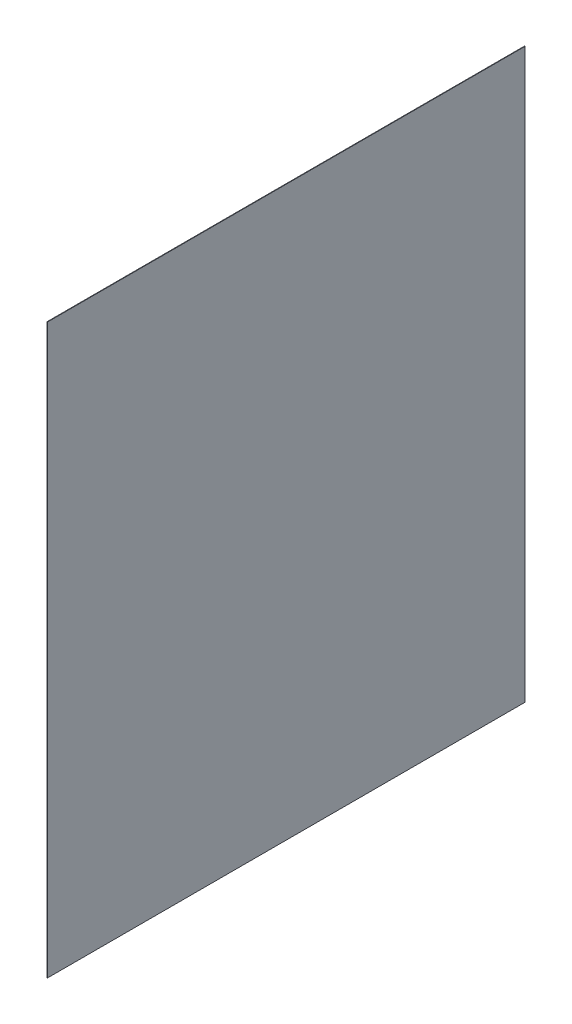
ISO-10303-21;
HEADER;
FILE_DESCRIPTION(('STEP AP214'),'2;1');
FILE_NAME('part.step','',(''),(''),'','','');
FILE_SCHEMA(('AUTOMOTIVE_DESIGN { 1 0 10303 214 1 1 1 1 }'));
ENDSEC;
DATA;
#1=APPLICATION_CONTEXT('core data for automotive mechanical design processes');
#2=APPLICATION_PROTOCOL_DEFINITION('international standard','automotive_design',2000,#1);
#3=PRODUCT_CONTEXT('',#1,'mechanical');
#4=PRODUCT('Part','Part','',(#3));
#5=PRODUCT_RELATED_PRODUCT_CATEGORY('part','',(#4));
#6=PRODUCT_DEFINITION_FORMATION('','',#4);
#7=PRODUCT_DEFINITION_CONTEXT('part definition',#1,'design');
#8=PRODUCT_DEFINITION('design','',#6,#7);
#9=PRODUCT_DEFINITION_SHAPE('','',#8);
#10=(LENGTH_UNIT() NAMED_UNIT(*) SI_UNIT(.MILLI.,.METRE.));
#11=(NAMED_UNIT(*) PLANE_ANGLE_UNIT() SI_UNIT($,.RADIAN.));
#12=(NAMED_UNIT(*) SI_UNIT($,.STERADIAN.) SOLID_ANGLE_UNIT());
#13=UNCERTAINTY_MEASURE_WITH_UNIT(LENGTH_MEASURE(1.E-05),#10,'distance_accuracy_value','');
#14=(GEOMETRIC_REPRESENTATION_CONTEXT(3) GLOBAL_UNCERTAINTY_ASSIGNED_CONTEXT((#13)) GLOBAL_UNIT_ASSIGNED_CONTEXT((#10,
#11,#12)) REPRESENTATION_CONTEXT('',''));
#15=CARTESIAN_POINT('',(0.,0.,0.));
#16=DIRECTION('',(0.,0.,1.));
#17=DIRECTION('',(1.,0.,0.));
#18=AXIS2_PLACEMENT_3D('',#15,#16,#17);
#19=CARTESIAN_POINT('',(-0.7,0.,0.));
#20=DIRECTION('',(0.,0.,1.));
#21=DIRECTION('',(1.,0.,0.));
#22=AXIS2_PLACEMENT_3D('',#19,#20,#21);
#23=PLANE('',#22);
#24=DIRECTION('',(0.,-1.,0.));
#25=VECTOR('',#24,1.);
#26=CARTESIAN_POINT('',(0.,0.,0.));
#27=LINE('',#26,#25);
#28=CARTESIAN_POINT('',(0.,787.05,0.));
#29=VERTEX_POINT('',#28);
#30=CARTESIAN_POINT('',(0.,0.,0.));
#31=VERTEX_POINT('',#30);
#32=EDGE_CURVE('E103',#29,#31,#27,.T.);
#33=ORIENTED_EDGE('',*,*,#32,.F.);
#34=DIRECTION('',(1.,0.,0.));
#35=VECTOR('',#34,1.);
#36=CARTESIAN_POINT('',(-0.7,787.05,0.));
#37=LINE('',#36,#35);
#38=CARTESIAN_POINT('',(-0.7,787.05,0.));
#39=VERTEX_POINT('',#38);
#40=EDGE_CURVE('E11',#39,#29,#37,.T.);
#41=ORIENTED_EDGE('',*,*,#40,.F.);
#42=DIRECTION('',(0.,-1.,0.));
#43=VECTOR('',#42,1.);
#44=CARTESIAN_POINT('',(-0.7,0.,0.));
#45=LINE('',#44,#43);
#46=CARTESIAN_POINT('',(-0.7,0.,0.));
#47=VERTEX_POINT('',#46);
#48=EDGE_CURVE('E97',#39,#47,#45,.T.);
#49=ORIENTED_EDGE('',*,*,#48,.T.);
#50=DIRECTION('',(1.,0.,0.));
#51=VECTOR('',#50,1.);
#52=CARTESIAN_POINT('',(-0.7,0.,0.));
#53=LINE('',#52,#51);
#54=EDGE_CURVE('E42',#47,#31,#53,.T.);
#55=ORIENTED_EDGE('',*,*,#54,.T.);
#56=EDGE_LOOP('',(#33,#41,#49,#55));
#57=FACE_BOUND('',#56,.T.);
#58=ADVANCED_FACE('F39',(#57),#23,.T.);
#59=CARTESIAN_POINT('',(-0.7,787.05,0.));
#60=DIRECTION('',(0.,1.,0.));
#61=DIRECTION('',(0.,0.,1.));
#62=AXIS2_PLACEMENT_3D('',#59,#60,#61);
#63=PLANE('',#62);
#64=DIRECTION('',(0.,0.,1.));
#65=VECTOR('',#64,1.);
#66=CARTESIAN_POINT('',(0.,787.05,0.));
#67=LINE('',#66,#65);
#68=CARTESIAN_POINT('',(0.,787.05,-661.7));
#69=VERTEX_POINT('',#68);
#70=EDGE_CURVE('E99',#69,#29,#67,.T.);
#71=ORIENTED_EDGE('',*,*,#70,.F.);
#72=DIRECTION('',(1.,0.,0.));
#73=VECTOR('',#72,1.);
#74=CARTESIAN_POINT('',(-0.7,787.05,-661.7));
#75=LINE('',#74,#73);
#76=CARTESIAN_POINT('',(-0.7,787.05,-661.7));
#77=VERTEX_POINT('',#76);
#78=EDGE_CURVE('E48',#77,#69,#75,.T.);
#79=ORIENTED_EDGE('',*,*,#78,.F.);
#80=DIRECTION('',(0.,0.,1.));
#81=VECTOR('',#80,1.);
#82=CARTESIAN_POINT('',(-0.7,787.05,0.));
#83=LINE('',#82,#81);
#84=EDGE_CURVE('E94',#77,#39,#83,.T.);
#85=ORIENTED_EDGE('',*,*,#84,.T.);
#86=ORIENTED_EDGE('',*,*,#40,.T.);
#87=EDGE_LOOP('',(#71,#79,#85,#86));
#88=FACE_BOUND('',#87,.T.);
#89=ADVANCED_FACE('F113',(#88),#63,.T.);
#90=CARTESIAN_POINT('',(-0.7,0.,-661.7));
#91=DIRECTION('',(0.,0.,-1.));
#92=DIRECTION('',(-1.,0.,0.));
#93=AXIS2_PLACEMENT_3D('',#90,#91,#92);
#94=PLANE('',#93);
#95=DIRECTION('',(0.,1.,0.));
#96=VECTOR('',#95,1.);
#97=CARTESIAN_POINT('',(0.,0.,-661.7));
#98=LINE('',#97,#96);
#99=CARTESIAN_POINT('',(0.,0.,-661.7));
#100=VERTEX_POINT('',#99);
#101=EDGE_CURVE('E89',#100,#69,#98,.T.);
#102=ORIENTED_EDGE('',*,*,#101,.F.);
#103=DIRECTION('',(1.,0.,0.));
#104=VECTOR('',#103,1.);
#105=CARTESIAN_POINT('',(-0.7,0.,-661.7));
#106=LINE('',#105,#104);
#107=CARTESIAN_POINT('',(-0.7,0.,-661.7));
#108=VERTEX_POINT('',#107);
#109=EDGE_CURVE('E84',#108,#100,#106,.T.);
#110=ORIENTED_EDGE('',*,*,#109,.F.);
#111=DIRECTION('',(0.,1.,0.));
#112=VECTOR('',#111,1.);
#113=CARTESIAN_POINT('',(-0.7,0.,-661.7));
#114=LINE('',#113,#112);
#115=EDGE_CURVE('E87',#108,#77,#114,.T.);
#116=ORIENTED_EDGE('',*,*,#115,.T.);
#117=ORIENTED_EDGE('',*,*,#78,.T.);
#118=EDGE_LOOP('',(#102,#110,#116,#117));
#119=FACE_BOUND('',#118,.T.);
#120=ADVANCED_FACE('F86',(#119),#94,.T.);
#121=CARTESIAN_POINT('',(-0.7,0.,0.));
#122=DIRECTION('',(0.,-1.,0.));
#123=DIRECTION('',(0.,0.,-1.));
#124=AXIS2_PLACEMENT_3D('',#121,#122,#123);
#125=PLANE('',#124);
#126=DIRECTION('',(0.,0.,-1.));
#127=VECTOR('',#126,1.);
#128=CARTESIAN_POINT('',(0.,0.,0.));
#129=LINE('',#128,#127);
#130=EDGE_CURVE('E106',#31,#100,#129,.T.);
#131=ORIENTED_EDGE('',*,*,#130,.F.);
#132=ORIENTED_EDGE('',*,*,#54,.F.);
#133=DIRECTION('',(0.,0.,-1.));
#134=VECTOR('',#133,1.);
#135=CARTESIAN_POINT('',(-0.7,0.,0.));
#136=LINE('',#135,#134);
#137=EDGE_CURVE('E93',#47,#108,#136,.T.);
#138=ORIENTED_EDGE('',*,*,#137,.T.);
#139=ORIENTED_EDGE('',*,*,#109,.T.);
#140=EDGE_LOOP('',(#131,#132,#138,#139));
#141=FACE_BOUND('',#140,.T.);
#142=ADVANCED_FACE('F96',(#141),#125,.T.);
#143=CARTESIAN_POINT('',(-0.7,0.,0.));
#144=DIRECTION('',(-1.,0.,0.));
#145=DIRECTION('',(0.,0.,1.));
#146=AXIS2_PLACEMENT_3D('',#143,#144,#145);
#147=PLANE('',#146);
#148=ORIENTED_EDGE('',*,*,#48,.F.);
#149=ORIENTED_EDGE('',*,*,#84,.F.);
#150=ORIENTED_EDGE('',*,*,#115,.F.);
#151=ORIENTED_EDGE('',*,*,#137,.F.);
#152=EDGE_LOOP('',(#148,#149,#150,#151));
#153=FACE_BOUND('',#152,.T.);
#154=ADVANCED_FACE('F92',(#153),#147,.T.);
#155=CARTESIAN_POINT('',(0.,0.,0.));
#156=DIRECTION('',(-1.,0.,0.));
#157=DIRECTION('',(0.,0.,1.));
#158=AXIS2_PLACEMENT_3D('',#155,#156,#157);
#159=PLANE('',#158);
#160=ORIENTED_EDGE('',*,*,#32,.T.);
#161=ORIENTED_EDGE('',*,*,#130,.T.);
#162=ORIENTED_EDGE('',*,*,#101,.T.);
#163=ORIENTED_EDGE('',*,*,#70,.T.);
#164=EDGE_LOOP('',(#160,#161,#162,#163));
#165=FACE_BOUND('',#164,.T.);
#166=ADVANCED_FACE('F112',(#165),#159,.F.);
#167=CLOSED_SHELL('',(#58,#89,#120,#142,#154,#166));
#168=MANIFOLD_SOLID_BREP('B2',#167);
#169=ADVANCED_BREP_SHAPE_REPRESENTATION('',(#18,#168),#14);
#170=SHAPE_DEFINITION_REPRESENTATION(#9,#169);
ENDSEC;
END-ISO-10303-21;
